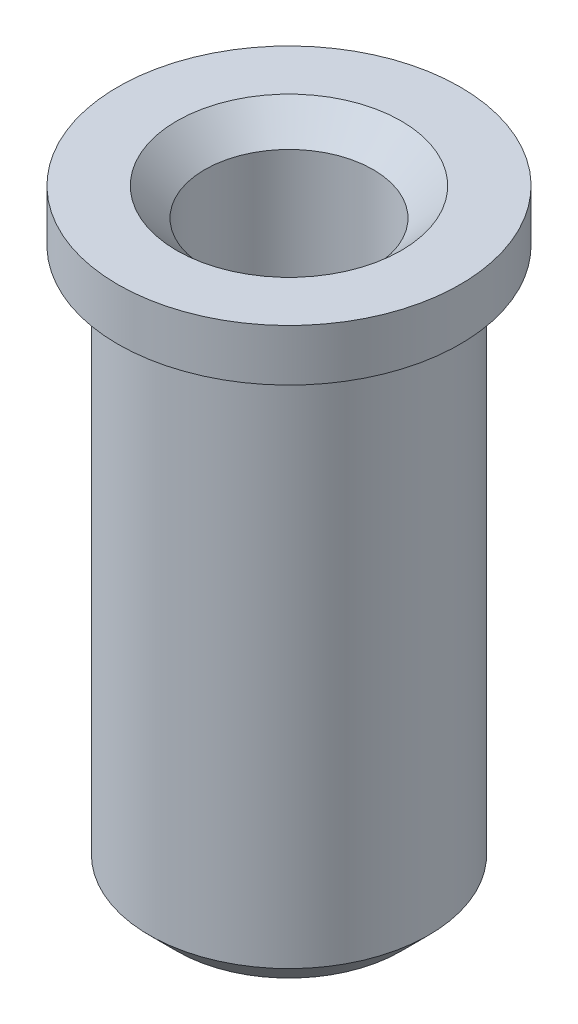
ISO-10303-21;
HEADER;
FILE_DESCRIPTION(('STEP AP214'),'2;1');
FILE_NAME('part.step','',(''),(''),'','','');
FILE_SCHEMA(('AUTOMOTIVE_DESIGN { 1 0 10303 214 1 1 1 1 }'));
ENDSEC;
DATA;
#1=APPLICATION_CONTEXT('core data for automotive mechanical design processes');
#2=APPLICATION_PROTOCOL_DEFINITION('international standard','automotive_design',2000,#1);
#3=PRODUCT_CONTEXT('',#1,'mechanical');
#4=PRODUCT('Part','Part','',(#3));
#5=PRODUCT_RELATED_PRODUCT_CATEGORY('part','',(#4));
#6=PRODUCT_DEFINITION_FORMATION('','',#4);
#7=PRODUCT_DEFINITION_CONTEXT('part definition',#1,'design');
#8=PRODUCT_DEFINITION('design','',#6,#7);
#9=PRODUCT_DEFINITION_SHAPE('','',#8);
#10=(LENGTH_UNIT() NAMED_UNIT(*) SI_UNIT(.MILLI.,.METRE.));
#11=(NAMED_UNIT(*) PLANE_ANGLE_UNIT() SI_UNIT($,.RADIAN.));
#12=(NAMED_UNIT(*) SI_UNIT($,.STERADIAN.) SOLID_ANGLE_UNIT());
#13=UNCERTAINTY_MEASURE_WITH_UNIT(LENGTH_MEASURE(1.E-05),#10,'distance_accuracy_value','');
#14=(GEOMETRIC_REPRESENTATION_CONTEXT(3) GLOBAL_UNCERTAINTY_ASSIGNED_CONTEXT((#13)) GLOBAL_UNIT_ASSIGNED_CONTEXT((#10,
#11,#12)) REPRESENTATION_CONTEXT('',''));
#15=CARTESIAN_POINT('',(0.,0.,0.));
#16=DIRECTION('',(0.,0.,1.));
#17=DIRECTION('',(1.,0.,0.));
#18=AXIS2_PLACEMENT_3D('',#15,#16,#17);
#19=CARTESIAN_POINT('',(0.,2.705,0.));
#20=DIRECTION('',(0.,1.,0.));
#21=DIRECTION('',(0.,0.,1.));
#22=AXIS2_PLACEMENT_3D('',#19,#20,#21);
#23=PLANE('',#22);
#24=CARTESIAN_POINT('',(0.,2.705,0.));
#25=DIRECTION('',(0.,1.,0.));
#26=DIRECTION('',(0.,0.,1.));
#27=AXIS2_PLACEMENT_3D('',#24,#25,#26);
#28=CIRCLE('',#27,1.);
#29=CARTESIAN_POINT('',(0.,2.705,1.));
#30=VERTEX_POINT('',#29);
#31=EDGE_CURVE('E11',#30,#30,#28,.F.);
#32=ORIENTED_EDGE('',*,*,#31,.T.);
#33=EDGE_LOOP('',(#32));
#34=FACE_BOUND('',#33,.T.);
#35=CARTESIAN_POINT('',(0.,2.705,0.));
#36=DIRECTION('',(0.,-1.,0.));
#37=DIRECTION('',(0.,0.,-1.));
#38=AXIS2_PLACEMENT_3D('',#35,#36,#37);
#39=CIRCLE('',#38,1.525);
#40=CARTESIAN_POINT('',(0.,2.705,-1.525));
#41=VERTEX_POINT('',#40);
#42=EDGE_CURVE('E62',#41,#41,#39,.T.);
#43=ORIENTED_EDGE('',*,*,#42,.F.);
#44=EDGE_LOOP('',(#43));
#45=FACE_BOUND('',#44,.T.);
#46=ADVANCED_FACE('F34',(#34,#45),#23,.T.);
#47=CARTESIAN_POINT('',(0.,0.,0.));
#48=DIRECTION('',(0.,-1.,0.));
#49=DIRECTION('',(0.,0.,-1.));
#50=AXIS2_PLACEMENT_3D('',#47,#48,#49);
#51=CYLINDRICAL_SURFACE('',#50,1.525);
#52=ORIENTED_EDGE('',*,*,#42,.T.);
#53=EDGE_LOOP('',(#52));
#54=FACE_BOUND('',#53,.T.);
#55=CARTESIAN_POINT('',(0.,2.245,0.));
#56=DIRECTION('',(0.,-1.,0.));
#57=DIRECTION('',(0.,0.,-1.));
#58=AXIS2_PLACEMENT_3D('',#55,#56,#57);
#59=CIRCLE('',#58,1.525);
#60=CARTESIAN_POINT('',(0.,2.245,-1.525));
#61=VERTEX_POINT('',#60);
#62=EDGE_CURVE('E57',#61,#61,#59,.T.);
#63=ORIENTED_EDGE('',*,*,#62,.F.);
#64=EDGE_LOOP('',(#63));
#65=FACE_BOUND('',#64,.T.);
#66=ADVANCED_FACE('F83',(#54,#65),#51,.T.);
#67=CARTESIAN_POINT('',(0.,2.245,-1.525));
#68=DIRECTION('',(0.,-1.,0.));
#69=DIRECTION('',(0.,0.,-1.));
#70=AXIS2_PLACEMENT_3D('',#67,#68,#69);
#71=PLANE('',#70);
#72=ORIENTED_EDGE('',*,*,#62,.T.);
#73=EDGE_LOOP('',(#72));
#74=FACE_BOUND('',#73,.T.);
#75=CARTESIAN_POINT('',(0.,2.245,0.));
#76=DIRECTION('',(0.,-1.,0.));
#77=DIRECTION('',(0.,0.,-1.));
#78=AXIS2_PLACEMENT_3D('',#75,#76,#77);
#79=CIRCLE('',#78,1.245);
#80=CARTESIAN_POINT('',(0.,2.245,-1.245));
#81=VERTEX_POINT('',#80);
#82=EDGE_CURVE('E54',#81,#81,#79,.T.);
#83=ORIENTED_EDGE('',*,*,#82,.F.);
#84=EDGE_LOOP('',(#83));
#85=FACE_BOUND('',#84,.T.);
#86=ADVANCED_FACE('F89',(#74,#85),#71,.T.);
#87=CARTESIAN_POINT('',(0.,0.,0.));
#88=DIRECTION('',(0.,-1.,0.));
#89=DIRECTION('',(0.,0.,-1.));
#90=AXIS2_PLACEMENT_3D('',#87,#88,#89);
#91=CYLINDRICAL_SURFACE('',#90,1.245);
#92=CARTESIAN_POINT('',(0.,-2.455,0.));
#93=DIRECTION('',(0.,-1.,0.));
#94=DIRECTION('',(0.,0.,-1.));
#95=AXIS2_PLACEMENT_3D('',#92,#93,#94);
#96=CIRCLE('',#95,1.245);
#97=CARTESIAN_POINT('',(0.,-2.455,-1.245));
#98=VERTEX_POINT('',#97);
#99=EDGE_CURVE('E68',#98,#98,#96,.F.);
#100=ORIENTED_EDGE('',*,*,#99,.T.);
#101=EDGE_LOOP('',(#100));
#102=FACE_BOUND('',#101,.T.);
#103=ORIENTED_EDGE('',*,*,#82,.T.);
#104=EDGE_LOOP('',(#103));
#105=FACE_BOUND('',#104,.T.);
#106=ADVANCED_FACE('F96',(#102,#105),#91,.T.);
#107=CARTESIAN_POINT('',(0.,-2.705,-1.245));
#108=DIRECTION('',(0.,-1.,0.));
#109=DIRECTION('',(0.,0.,-1.));
#110=AXIS2_PLACEMENT_3D('',#107,#108,#109);
#111=PLANE('',#110);
#112=CARTESIAN_POINT('',(0.,-2.705,0.));
#113=DIRECTION('',(0.,-1.,0.));
#114=DIRECTION('',(0.,0.,-1.));
#115=AXIS2_PLACEMENT_3D('',#112,#113,#114);
#116=CIRCLE('',#115,0.995);
#117=CARTESIAN_POINT('',(0.,-2.705,-0.995));
#118=VERTEX_POINT('',#117);
#119=EDGE_CURVE('E65',#118,#118,#116,.T.);
#120=ORIENTED_EDGE('',*,*,#119,.T.);
#121=EDGE_LOOP('',(#120));
#122=FACE_BOUND('',#121,.T.);
#123=ADVANCED_FACE('F48',(#122),#111,.T.);
#124=CARTESIAN_POINT('',(0.,-1.865,0.));
#125=DIRECTION('',(0.,1.,0.));
#126=DIRECTION('',(0.,0.,1.));
#127=AXIS2_PLACEMENT_3D('',#124,#125,#126);
#128=CONICAL_SURFACE('',#127,0.749999999999999,1.02974425867665);
#129=CARTESIAN_POINT('',(0.,-2.31564546427067,0.));
#130=VERTEX_POINT('',#129);
#131=VERTEX_LOOP('',#130);
#132=FACE_BOUND('',#131,.T.);
#133=CARTESIAN_POINT('',(0.,-1.865,0.));
#134=DIRECTION('',(0.,1.,0.));
#135=DIRECTION('',(0.,0.,1.));
#136=AXIS2_PLACEMENT_3D('',#133,#134,#135);
#137=CIRCLE('',#136,0.749999999999999);
#138=CARTESIAN_POINT('',(0.,-1.865,0.749999999999999));
#139=VERTEX_POINT('',#138);
#140=EDGE_CURVE('E52',#139,#139,#137,.T.);
#141=ORIENTED_EDGE('',*,*,#140,.T.);
#142=EDGE_LOOP('',(#141));
#143=FACE_BOUND('',#142,.T.);
#144=ADVANCED_FACE('F44',(#132,#143),#128,.F.);
#145=CARTESIAN_POINT('',(0.,2.705,0.));
#146=DIRECTION('',(0.,1.,0.));
#147=DIRECTION('',(0.,0.,1.));
#148=AXIS2_PLACEMENT_3D('',#145,#146,#147);
#149=CYLINDRICAL_SURFACE('',#148,0.749999999999999);
#150=CARTESIAN_POINT('',(0.,2.455,0.));
#151=DIRECTION('',(0.,1.,0.));
#152=DIRECTION('',(0.,0.,1.));
#153=AXIS2_PLACEMENT_3D('',#150,#151,#152);
#154=CIRCLE('',#153,0.749999999999999);
#155=CARTESIAN_POINT('',(0.,2.455,0.749999999999999));
#156=VERTEX_POINT('',#155);
#157=EDGE_CURVE('E41',#156,#156,#154,.T.);
#158=ORIENTED_EDGE('',*,*,#157,.T.);
#159=EDGE_LOOP('',(#158));
#160=FACE_BOUND('',#159,.T.);
#161=ORIENTED_EDGE('',*,*,#140,.F.);
#162=EDGE_LOOP('',(#161));
#163=FACE_BOUND('',#162,.T.);
#164=ADVANCED_FACE('F47',(#160,#163),#149,.F.);
#165=CARTESIAN_POINT('',(0.,-2.705,0.));
#166=DIRECTION('',(0.,1.,0.));
#167=DIRECTION('',(0.,0.,1.));
#168=AXIS2_PLACEMENT_3D('',#165,#166,#167);
#169=CONICAL_SURFACE('',#168,0.995,0.785398163397449);
#170=ORIENTED_EDGE('',*,*,#99,.F.);
#171=EDGE_LOOP('',(#170));
#172=FACE_BOUND('',#171,.T.);
#173=ORIENTED_EDGE('',*,*,#119,.F.);
#174=EDGE_LOOP('',(#173));
#175=FACE_BOUND('',#174,.T.);
#176=ADVANCED_FACE('F75',(#172,#175),#169,.T.);
#177=CARTESIAN_POINT('',(0.,2.455,0.));
#178=DIRECTION('',(0.,1.,0.));
#179=DIRECTION('',(0.,0.,1.));
#180=AXIS2_PLACEMENT_3D('',#177,#178,#179);
#181=CONICAL_SURFACE('',#180,0.749999999999999,0.785398163397451);
#182=ORIENTED_EDGE('',*,*,#31,.F.);
#183=EDGE_LOOP('',(#182));
#184=FACE_BOUND('',#183,.T.);
#185=ORIENTED_EDGE('',*,*,#157,.F.);
#186=EDGE_LOOP('',(#185));
#187=FACE_BOUND('',#186,.T.);
#188=ADVANCED_FACE('F36',(#184,#187),#181,.F.);
#189=CLOSED_SHELL('',(#46,#66,#86,#106,#123,#144,#164,#176,#188));
#190=MANIFOLD_SOLID_BREP('B2',#189);
#191=ADVANCED_BREP_SHAPE_REPRESENTATION('',(#18,#190),#14);
#192=SHAPE_DEFINITION_REPRESENTATION(#9,#191);
ENDSEC;
END-ISO-10303-21;
